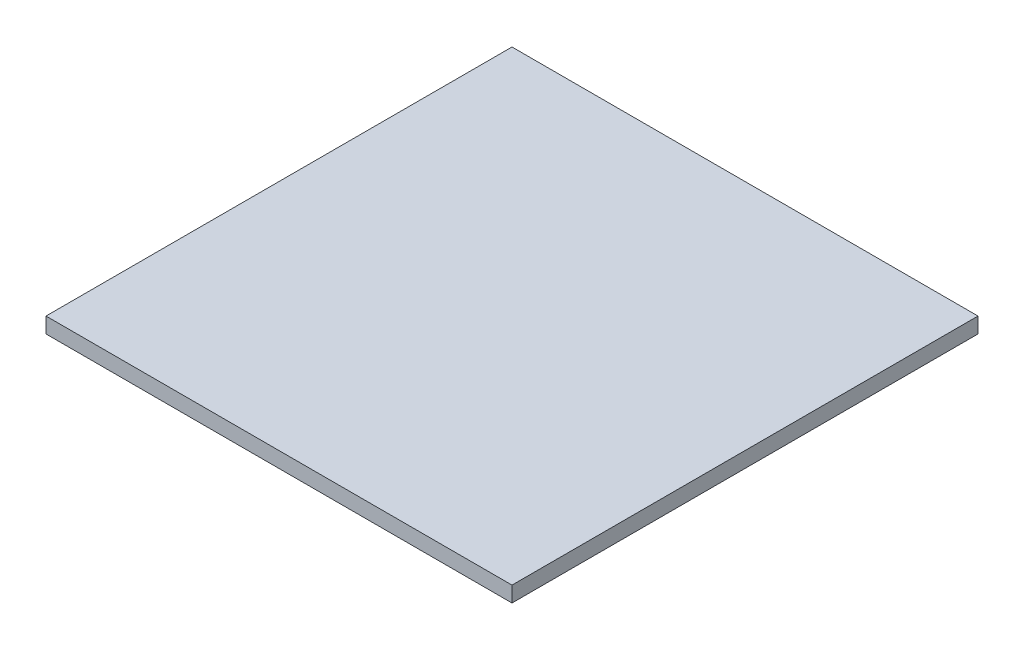
ISO-10303-21;
HEADER;
FILE_DESCRIPTION(('STEP AP214'),'2;1');
FILE_NAME('part.step','',(''),(''),'','','');
FILE_SCHEMA(('AUTOMOTIVE_DESIGN { 1 0 10303 214 1 1 1 1 }'));
ENDSEC;
DATA;
#1=APPLICATION_CONTEXT('core data for automotive mechanical design processes');
#2=APPLICATION_PROTOCOL_DEFINITION('international standard','automotive_design',2000,#1);
#3=PRODUCT_CONTEXT('',#1,'mechanical');
#4=PRODUCT('Part','Part','',(#3));
#5=PRODUCT_RELATED_PRODUCT_CATEGORY('part','',(#4));
#6=PRODUCT_DEFINITION_FORMATION('','',#4);
#7=PRODUCT_DEFINITION_CONTEXT('part definition',#1,'design');
#8=PRODUCT_DEFINITION('design','',#6,#7);
#9=PRODUCT_DEFINITION_SHAPE('','',#8);
#10=(LENGTH_UNIT() NAMED_UNIT(*) SI_UNIT(.MILLI.,.METRE.));
#11=(NAMED_UNIT(*) PLANE_ANGLE_UNIT() SI_UNIT($,.RADIAN.));
#12=(NAMED_UNIT(*) SI_UNIT($,.STERADIAN.) SOLID_ANGLE_UNIT());
#13=UNCERTAINTY_MEASURE_WITH_UNIT(LENGTH_MEASURE(1.E-05),#10,'distance_accuracy_value','');
#14=(GEOMETRIC_REPRESENTATION_CONTEXT(3) GLOBAL_UNCERTAINTY_ASSIGNED_CONTEXT((#13)) GLOBAL_UNIT_ASSIGNED_CONTEXT((#10,
#11,#12)) REPRESENTATION_CONTEXT('',''));
#15=CARTESIAN_POINT('',(0.,0.,0.));
#16=DIRECTION('',(0.,0.,1.));
#17=DIRECTION('',(1.,0.,0.));
#18=AXIS2_PLACEMENT_3D('',#15,#16,#17);
#19=CARTESIAN_POINT('',(150.,10.,-150.));
#20=DIRECTION('',(-1.,0.,0.));
#21=DIRECTION('',(0.,0.,1.));
#22=AXIS2_PLACEMENT_3D('',#19,#20,#21);
#23=PLANE('',#22);
#24=DIRECTION('',(0.,0.,-1.));
#25=VECTOR('',#24,1.);
#26=CARTESIAN_POINT('',(150.,0.,-150.));
#27=LINE('',#26,#25);
#28=CARTESIAN_POINT('',(150.,0.,150.));
#29=VERTEX_POINT('',#28);
#30=CARTESIAN_POINT('',(150.,0.,-150.));
#31=VERTEX_POINT('',#30);
#32=EDGE_CURVE('E96',#29,#31,#27,.T.);
#33=ORIENTED_EDGE('',*,*,#32,.T.);
#34=DIRECTION('',(0.,-1.,0.));
#35=VECTOR('',#34,1.);
#36=CARTESIAN_POINT('',(150.,10.,-150.));
#37=LINE('',#36,#35);
#38=CARTESIAN_POINT('',(150.,10.,-150.));
#39=VERTEX_POINT('',#38);
#40=EDGE_CURVE('E11',#39,#31,#37,.T.);
#41=ORIENTED_EDGE('',*,*,#40,.F.);
#42=DIRECTION('',(0.,0.,-1.));
#43=VECTOR('',#42,1.);
#44=CARTESIAN_POINT('',(150.,10.,-150.));
#45=LINE('',#44,#43);
#46=CARTESIAN_POINT('',(150.,10.,150.));
#47=VERTEX_POINT('',#46);
#48=EDGE_CURVE('E84',#47,#39,#45,.T.);
#49=ORIENTED_EDGE('',*,*,#48,.F.);
#50=DIRECTION('',(0.,-1.,0.));
#51=VECTOR('',#50,1.);
#52=CARTESIAN_POINT('',(150.,10.,150.));
#53=LINE('',#52,#51);
#54=EDGE_CURVE('E92',#47,#29,#53,.T.);
#55=ORIENTED_EDGE('',*,*,#54,.T.);
#56=EDGE_LOOP('',(#33,#41,#49,#55));
#57=FACE_BOUND('',#56,.T.);
#58=ADVANCED_FACE('F33',(#57),#23,.F.);
#59=CARTESIAN_POINT('',(-150.,10.,-150.));
#60=DIRECTION('',(0.,0.,1.));
#61=DIRECTION('',(1.,0.,0.));
#62=AXIS2_PLACEMENT_3D('',#59,#60,#61);
#63=PLANE('',#62);
#64=DIRECTION('',(-1.,0.,0.));
#65=VECTOR('',#64,1.);
#66=CARTESIAN_POINT('',(-150.,0.,-150.));
#67=LINE('',#66,#65);
#68=CARTESIAN_POINT('',(-150.,0.,-150.));
#69=VERTEX_POINT('',#68);
#70=EDGE_CURVE('E88',#31,#69,#67,.T.);
#71=ORIENTED_EDGE('',*,*,#70,.T.);
#72=DIRECTION('',(0.,-1.,0.));
#73=VECTOR('',#72,1.);
#74=CARTESIAN_POINT('',(-150.,10.,-150.));
#75=LINE('',#74,#73);
#76=CARTESIAN_POINT('',(-150.,10.,-150.));
#77=VERTEX_POINT('',#76);
#78=EDGE_CURVE('E41',#77,#69,#75,.T.);
#79=ORIENTED_EDGE('',*,*,#78,.F.);
#80=DIRECTION('',(-1.,0.,0.));
#81=VECTOR('',#80,1.);
#82=CARTESIAN_POINT('',(-150.,10.,-150.));
#83=LINE('',#82,#81);
#84=EDGE_CURVE('E79',#39,#77,#83,.T.);
#85=ORIENTED_EDGE('',*,*,#84,.F.);
#86=ORIENTED_EDGE('',*,*,#40,.T.);
#87=EDGE_LOOP('',(#71,#79,#85,#86));
#88=FACE_BOUND('',#87,.T.);
#89=ADVANCED_FACE('F87',(#88),#63,.F.);
#90=CARTESIAN_POINT('',(-150.,10.,-150.));
#91=DIRECTION('',(1.,0.,0.));
#92=DIRECTION('',(0.,0.,-1.));
#93=AXIS2_PLACEMENT_3D('',#90,#91,#92);
#94=PLANE('',#93);
#95=DIRECTION('',(0.,0.,1.));
#96=VECTOR('',#95,1.);
#97=CARTESIAN_POINT('',(-150.,0.,-150.));
#98=LINE('',#97,#96);
#99=CARTESIAN_POINT('',(-150.,0.,150.));
#100=VERTEX_POINT('',#99);
#101=EDGE_CURVE('E66',#69,#100,#98,.T.);
#102=ORIENTED_EDGE('',*,*,#101,.T.);
#103=DIRECTION('',(0.,-1.,0.));
#104=VECTOR('',#103,1.);
#105=CARTESIAN_POINT('',(-150.,10.,150.));
#106=LINE('',#105,#104);
#107=CARTESIAN_POINT('',(-150.,10.,150.));
#108=VERTEX_POINT('',#107);
#109=EDGE_CURVE('E89',#108,#100,#106,.T.);
#110=ORIENTED_EDGE('',*,*,#109,.F.);
#111=DIRECTION('',(0.,0.,1.));
#112=VECTOR('',#111,1.);
#113=CARTESIAN_POINT('',(-150.,10.,-150.));
#114=LINE('',#113,#112);
#115=EDGE_CURVE('E82',#77,#108,#114,.T.);
#116=ORIENTED_EDGE('',*,*,#115,.F.);
#117=ORIENTED_EDGE('',*,*,#78,.T.);
#118=EDGE_LOOP('',(#102,#110,#116,#117));
#119=FACE_BOUND('',#118,.T.);
#120=ADVANCED_FACE('F90',(#119),#94,.F.);
#121=CARTESIAN_POINT('',(-150.,10.,150.));
#122=DIRECTION('',(0.,0.,-1.));
#123=DIRECTION('',(-1.,0.,0.));
#124=AXIS2_PLACEMENT_3D('',#121,#122,#123);
#125=PLANE('',#124);
#126=DIRECTION('',(1.,0.,0.));
#127=VECTOR('',#126,1.);
#128=CARTESIAN_POINT('',(-150.,0.,150.));
#129=LINE('',#128,#127);
#130=EDGE_CURVE('E72',#100,#29,#129,.T.);
#131=ORIENTED_EDGE('',*,*,#130,.T.);
#132=ORIENTED_EDGE('',*,*,#54,.F.);
#133=DIRECTION('',(1.,0.,0.));
#134=VECTOR('',#133,1.);
#135=CARTESIAN_POINT('',(-150.,10.,150.));
#136=LINE('',#135,#134);
#137=EDGE_CURVE('E49',#108,#47,#136,.T.);
#138=ORIENTED_EDGE('',*,*,#137,.F.);
#139=ORIENTED_EDGE('',*,*,#109,.T.);
#140=EDGE_LOOP('',(#131,#132,#138,#139));
#141=FACE_BOUND('',#140,.T.);
#142=ADVANCED_FACE('F103',(#141),#125,.F.);
#143=CARTESIAN_POINT('',(0.,10.,0.));
#144=DIRECTION('',(0.,1.,0.));
#145=DIRECTION('',(0.,0.,1.));
#146=AXIS2_PLACEMENT_3D('',#143,#144,#145);
#147=PLANE('',#146);
#148=ORIENTED_EDGE('',*,*,#48,.T.);
#149=ORIENTED_EDGE('',*,*,#84,.T.);
#150=ORIENTED_EDGE('',*,*,#115,.T.);
#151=ORIENTED_EDGE('',*,*,#137,.T.);
#152=EDGE_LOOP('',(#148,#149,#150,#151));
#153=FACE_BOUND('',#152,.T.);
#154=ADVANCED_FACE('F80',(#153),#147,.T.);
#155=CARTESIAN_POINT('',(0.,0.,0.));
#156=DIRECTION('',(0.,1.,0.));
#157=DIRECTION('',(0.,0.,1.));
#158=AXIS2_PLACEMENT_3D('',#155,#156,#157);
#159=PLANE('',#158);
#160=ORIENTED_EDGE('',*,*,#32,.F.);
#161=ORIENTED_EDGE('',*,*,#130,.F.);
#162=ORIENTED_EDGE('',*,*,#101,.F.);
#163=ORIENTED_EDGE('',*,*,#70,.F.);
#164=EDGE_LOOP('',(#160,#161,#162,#163));
#165=FACE_BOUND('',#164,.T.);
#166=ADVANCED_FACE('F106',(#165),#159,.F.);
#167=CLOSED_SHELL('',(#58,#89,#120,#142,#154,#166));
#168=MANIFOLD_SOLID_BREP('B2',#167);
#169=ADVANCED_BREP_SHAPE_REPRESENTATION('',(#18,#168),#14);
#170=SHAPE_DEFINITION_REPRESENTATION(#9,#169);
ENDSEC;
END-ISO-10303-21;
